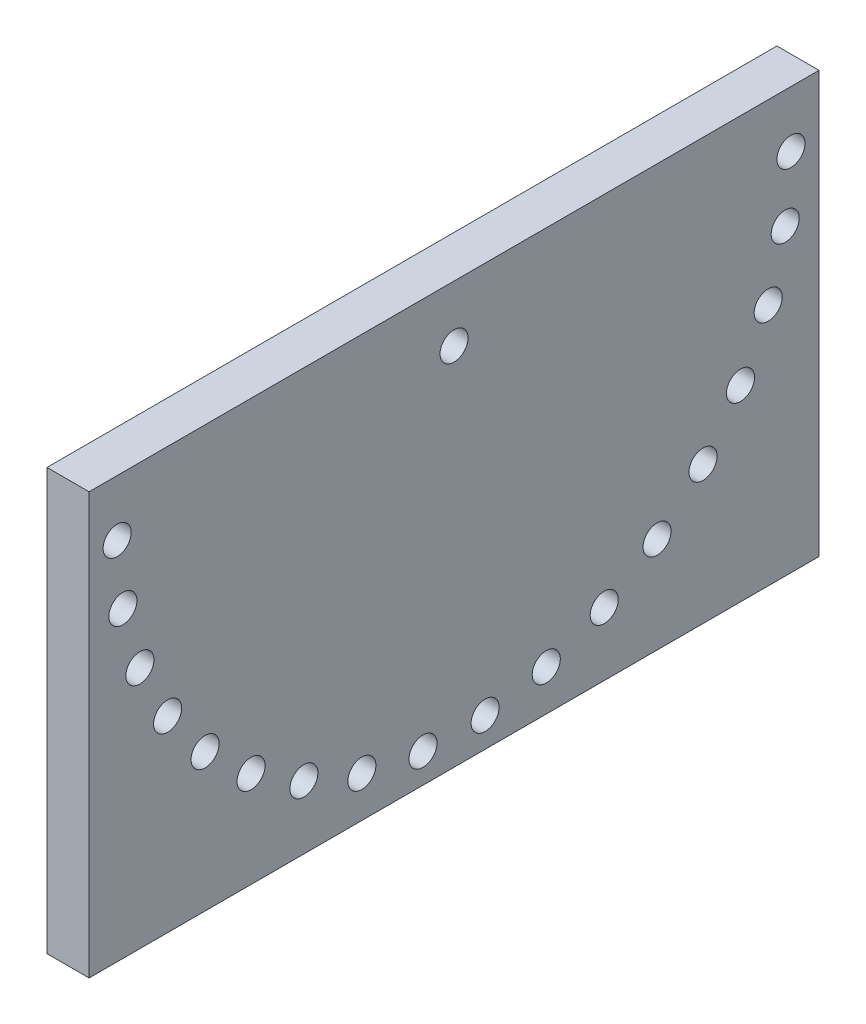
ISO-10303-21;
HEADER;
FILE_DESCRIPTION(('STEP AP214'),'2;1');
FILE_NAME('part.step','',(''),(''),'','','');
FILE_SCHEMA(('AUTOMOTIVE_DESIGN { 1 0 10303 214 1 1 1 1 }'));
ENDSEC;
DATA;
#1=APPLICATION_CONTEXT('core data for automotive mechanical design processes');
#2=APPLICATION_PROTOCOL_DEFINITION('international standard','automotive_design',2000,#1);
#3=PRODUCT_CONTEXT('',#1,'mechanical');
#4=PRODUCT('Part','Part','',(#3));
#5=PRODUCT_RELATED_PRODUCT_CATEGORY('part','',(#4));
#6=PRODUCT_DEFINITION_FORMATION('','',#4);
#7=PRODUCT_DEFINITION_CONTEXT('part definition',#1,'design');
#8=PRODUCT_DEFINITION('design','',#6,#7);
#9=PRODUCT_DEFINITION_SHAPE('','',#8);
#10=(LENGTH_UNIT() NAMED_UNIT(*) SI_UNIT(.MILLI.,.METRE.));
#11=(NAMED_UNIT(*) PLANE_ANGLE_UNIT() SI_UNIT($,.RADIAN.));
#12=(NAMED_UNIT(*) SI_UNIT($,.STERADIAN.) SOLID_ANGLE_UNIT());
#13=UNCERTAINTY_MEASURE_WITH_UNIT(LENGTH_MEASURE(1.E-05),#10,'distance_accuracy_value','');
#14=(GEOMETRIC_REPRESENTATION_CONTEXT(3) GLOBAL_UNCERTAINTY_ASSIGNED_CONTEXT((#13)) GLOBAL_UNIT_ASSIGNED_CONTEXT((#10,
#11,#12)) REPRESENTATION_CONTEXT('',''));
#15=CARTESIAN_POINT('',(0.,0.,0.));
#16=DIRECTION('',(0.,0.,1.));
#17=DIRECTION('',(1.,0.,0.));
#18=AXIS2_PLACEMENT_3D('',#15,#16,#17);
#19=CARTESIAN_POINT('',(15.,75.,-130.));
#20=DIRECTION('',(0.,0.,1.));
#21=DIRECTION('',(1.,0.,0.));
#22=AXIS2_PLACEMENT_3D('',#19,#20,#21);
#23=PLANE('',#22);
#24=DIRECTION('',(0.,1.,0.));
#25=VECTOR('',#24,1.);
#26=CARTESIAN_POINT('',(0.,75.,-130.));
#27=LINE('',#26,#25);
#28=CARTESIAN_POINT('',(0.,-75.,-130.));
#29=VERTEX_POINT('',#28);
#30=CARTESIAN_POINT('',(0.,75.,-130.));
#31=VERTEX_POINT('',#30);
#32=EDGE_CURVE('E100',#29,#31,#27,.T.);
#33=ORIENTED_EDGE('',*,*,#32,.T.);
#34=DIRECTION('',(-1.,0.,0.));
#35=VECTOR('',#34,1.);
#36=CARTESIAN_POINT('',(15.,75.,-130.));
#37=LINE('',#36,#35);
#38=CARTESIAN_POINT('',(15.,75.,-130.));
#39=VERTEX_POINT('',#38);
#40=EDGE_CURVE('E11',#39,#31,#37,.T.);
#41=ORIENTED_EDGE('',*,*,#40,.F.);
#42=DIRECTION('',(0.,1.,0.));
#43=VECTOR('',#42,1.);
#44=CARTESIAN_POINT('',(15.,75.,-130.));
#45=LINE('',#44,#43);
#46=CARTESIAN_POINT('',(15.,-75.,-130.));
#47=VERTEX_POINT('',#46);
#48=EDGE_CURVE('E88',#47,#39,#45,.T.);
#49=ORIENTED_EDGE('',*,*,#48,.F.);
#50=DIRECTION('',(-1.,0.,0.));
#51=VECTOR('',#50,1.);
#52=CARTESIAN_POINT('',(15.,-75.,-130.));
#53=LINE('',#52,#51);
#54=EDGE_CURVE('E96',#47,#29,#53,.T.);
#55=ORIENTED_EDGE('',*,*,#54,.T.);
#56=EDGE_LOOP('',(#33,#41,#49,#55));
#57=FACE_BOUND('',#56,.T.);
#58=ADVANCED_FACE('F37',(#57),#23,.F.);
#59=CARTESIAN_POINT('',(15.,75.,130.));
#60=DIRECTION('',(0.,-1.,0.));
#61=DIRECTION('',(0.,0.,-1.));
#62=AXIS2_PLACEMENT_3D('',#59,#60,#61);
#63=PLANE('',#62);
#64=DIRECTION('',(0.,0.,1.));
#65=VECTOR('',#64,1.);
#66=CARTESIAN_POINT('',(0.,75.,130.));
#67=LINE('',#66,#65);
#68=CARTESIAN_POINT('',(0.,75.,130.));
#69=VERTEX_POINT('',#68);
#70=EDGE_CURVE('E92',#31,#69,#67,.T.);
#71=ORIENTED_EDGE('',*,*,#70,.T.);
#72=DIRECTION('',(-1.,0.,0.));
#73=VECTOR('',#72,1.);
#74=CARTESIAN_POINT('',(15.,75.,130.));
#75=LINE('',#74,#73);
#76=CARTESIAN_POINT('',(15.,75.,130.));
#77=VERTEX_POINT('',#76);
#78=EDGE_CURVE('E45',#77,#69,#75,.T.);
#79=ORIENTED_EDGE('',*,*,#78,.F.);
#80=DIRECTION('',(0.,0.,1.));
#81=VECTOR('',#80,1.);
#82=CARTESIAN_POINT('',(15.,75.,130.));
#83=LINE('',#82,#81);
#84=EDGE_CURVE('E83',#39,#77,#83,.T.);
#85=ORIENTED_EDGE('',*,*,#84,.F.);
#86=ORIENTED_EDGE('',*,*,#40,.T.);
#87=EDGE_LOOP('',(#71,#79,#85,#86));
#88=FACE_BOUND('',#87,.T.);
#89=ADVANCED_FACE('F91',(#88),#63,.F.);
#90=CARTESIAN_POINT('',(15.,75.,130.));
#91=DIRECTION('',(0.,0.,-1.));
#92=DIRECTION('',(0.,1.,0.));
#93=AXIS2_PLACEMENT_3D('',#90,#91,#92);
#94=PLANE('',#93);
#95=DIRECTION('',(0.,-1.,0.));
#96=VECTOR('',#95,1.);
#97=CARTESIAN_POINT('',(0.,75.,130.));
#98=LINE('',#97,#96);
#99=CARTESIAN_POINT('',(0.,-75.,130.));
#100=VERTEX_POINT('',#99);
#101=EDGE_CURVE('E70',#69,#100,#98,.T.);
#102=ORIENTED_EDGE('',*,*,#101,.T.);
#103=DIRECTION('',(-1.,0.,0.));
#104=VECTOR('',#103,1.);
#105=CARTESIAN_POINT('',(15.,-75.,130.));
#106=LINE('',#105,#104);
#107=CARTESIAN_POINT('',(15.,-75.,130.));
#108=VERTEX_POINT('',#107);
#109=EDGE_CURVE('E93',#108,#100,#106,.T.);
#110=ORIENTED_EDGE('',*,*,#109,.F.);
#111=DIRECTION('',(0.,-1.,0.));
#112=VECTOR('',#111,1.);
#113=CARTESIAN_POINT('',(15.,75.,130.));
#114=LINE('',#113,#112);
#115=EDGE_CURVE('E86',#77,#108,#114,.T.);
#116=ORIENTED_EDGE('',*,*,#115,.F.);
#117=ORIENTED_EDGE('',*,*,#78,.T.);
#118=EDGE_LOOP('',(#102,#110,#116,#117));
#119=FACE_BOUND('',#118,.T.);
#120=ADVANCED_FACE('F94',(#119),#94,.F.);
#121=CARTESIAN_POINT('',(15.,-75.,130.));
#122=DIRECTION('',(0.,1.,0.));
#123=DIRECTION('',(0.,0.,1.));
#124=AXIS2_PLACEMENT_3D('',#121,#122,#123);
#125=PLANE('',#124);
#126=DIRECTION('',(0.,0.,-1.));
#127=VECTOR('',#126,1.);
#128=CARTESIAN_POINT('',(0.,-75.,130.));
#129=LINE('',#128,#127);
#130=EDGE_CURVE('E76',#100,#29,#129,.T.);
#131=ORIENTED_EDGE('',*,*,#130,.T.);
#132=ORIENTED_EDGE('',*,*,#54,.F.);
#133=DIRECTION('',(0.,0.,-1.));
#134=VECTOR('',#133,1.);
#135=CARTESIAN_POINT('',(15.,-75.,130.));
#136=LINE('',#135,#134);
#137=EDGE_CURVE('E53',#108,#47,#136,.T.);
#138=ORIENTED_EDGE('',*,*,#137,.F.);
#139=ORIENTED_EDGE('',*,*,#109,.T.);
#140=EDGE_LOOP('',(#131,#132,#138,#139));
#141=FACE_BOUND('',#140,.T.);
#142=ADVANCED_FACE('F108',(#141),#125,.F.);
#143=CARTESIAN_POINT('',(15.,0.,0.));
#144=DIRECTION('',(1.,0.,0.));
#145=DIRECTION('',(0.,0.,-1.));
#146=AXIS2_PLACEMENT_3D('',#143,#144,#145);
#147=PLANE('',#146);
#148=CARTESIAN_POINT('',(15.,55.0000000000008,120.));
#149=DIRECTION('',(-1.,0.,0.));
#150=DIRECTION('',(0.,0.,1.));
#151=AXIS2_PLACEMENT_3D('',#148,#149,#150);
#152=CIRCLE('',#151,5.00000000000002);
#153=CARTESIAN_POINT('',(15.,55.0000000000008,125.));
#154=VERTEX_POINT('',#153);
#155=EDGE_CURVE('E219',#154,#154,#152,.T.);
#156=ORIENTED_EDGE('',*,*,#155,.T.);
#157=EDGE_LOOP('',(#156));
#158=FACE_BOUND('',#157,.T.);
#159=CARTESIAN_POINT('',(15.,32.9500578620124,117.956771962068));
#160=DIRECTION('',(-1.,0.,0.));
#161=DIRECTION('',(0.,0.,1.));
#162=AXIS2_PLACEMENT_3D('',#159,#160,#161);
#163=CIRCLE('',#162,5.);
#164=CARTESIAN_POINT('',(15.,32.9500578620124,122.956771962068));
#165=VERTEX_POINT('',#164);
#166=EDGE_CURVE('E213',#165,#165,#163,.T.);
#167=ORIENTED_EDGE('',*,*,#166,.T.);
#168=EDGE_LOOP('',(#167));
#169=FACE_BOUND('',#168,.T.);
#170=CARTESIAN_POINT('',(15.,11.6510000575423,111.896667528523));
#171=DIRECTION('',(-1.,0.,0.));
#172=DIRECTION('',(0.,0.,1.));
#173=AXIS2_PLACEMENT_3D('',#170,#171,#172);
#174=CIRCLE('',#173,5.);
#175=CARTESIAN_POINT('',(15.,11.6510000575423,116.896667528523));
#176=VERTEX_POINT('',#175);
#177=EDGE_CURVE('E207',#176,#176,#174,.T.);
#178=ORIENTED_EDGE('',*,*,#177,.T.);
#179=EDGE_LOOP('',(#178));
#180=FACE_BOUND('',#179,.T.);
#181=CARTESIAN_POINT('',(15.,-8.17185954528207,102.026056287554));
#182=DIRECTION('',(-1.,0.,0.));
#183=DIRECTION('',(0.,0.,1.));
#184=AXIS2_PLACEMENT_3D('',#181,#182,#183);
#185=CIRCLE('',#184,5.);
#186=CARTESIAN_POINT('',(15.,-8.17185954528207,107.026056287554));
#187=VERTEX_POINT('',#186);
#188=EDGE_CURVE('E201',#187,#187,#185,.T.);
#189=ORIENTED_EDGE('',*,*,#188,.T.);
#190=EDGE_LOOP('',(#189));
#191=FACE_BOUND('',#190,.T.);
#192=CARTESIAN_POINT('',(15.,-25.8434772375864,88.6810700664795));
#193=DIRECTION('',(-1.,0.,0.));
#194=DIRECTION('',(0.,0.,1.));
#195=AXIS2_PLACEMENT_3D('',#192,#193,#194);
#196=CIRCLE('',#195,5.);
#197=CARTESIAN_POINT('',(15.,-25.8434772375864,93.6810700664795));
#198=VERTEX_POINT('',#197);
#199=EDGE_CURVE('E195',#198,#198,#196,.T.);
#200=ORIENTED_EDGE('',*,*,#199,.T.);
#201=EDGE_LOOP('',(#200));
#202=FACE_BOUND('',#201,.T.);
#203=CARTESIAN_POINT('',(15.,-40.7620672736284,72.3161563655112));
#204=DIRECTION('',(-1.,0.,0.));
#205=DIRECTION('',(0.,0.,1.));
#206=AXIS2_PLACEMENT_3D('',#203,#204,#205);
#207=CIRCLE('',#206,5.00000000000001);
#208=CARTESIAN_POINT('',(15.,-40.7620672736284,77.3161563655113));
#209=VERTEX_POINT('',#208);
#210=EDGE_CURVE('E189',#209,#209,#207,.T.);
#211=ORIENTED_EDGE('',*,*,#210,.T.);
#212=EDGE_LOOP('',(#211));
#213=FACE_BOUND('',#212,.T.);
#214=CARTESIAN_POINT('',(15.,-52.4195949626073,53.4886026931851));
#215=DIRECTION('',(-1.,0.,0.));
#216=DIRECTION('',(0.,0.,1.));
#217=AXIS2_PLACEMENT_3D('',#214,#215,#216);
#218=CIRCLE('',#217,5.00000000000002);
#219=CARTESIAN_POINT('',(15.,-52.4195949626073,58.4886026931851));
#220=VERTEX_POINT('',#219);
#221=EDGE_CURVE('E183',#220,#220,#218,.T.);
#222=ORIENTED_EDGE('',*,*,#221,.T.);
#223=EDGE_LOOP('',(#222));
#224=FACE_BOUND('',#223,.T.);
#225=CARTESIAN_POINT('',(15.,-60.4190771807382,32.8395588086504));
#226=DIRECTION('',(-1.,0.,0.));
#227=DIRECTION('',(0.,0.,1.));
#228=AXIS2_PLACEMENT_3D('',#225,#226,#227);
#229=CIRCLE('',#228,5.00000000000002);
#230=CARTESIAN_POINT('',(15.,-60.4190771807382,37.8395588086504));
#231=VERTEX_POINT('',#230);
#232=EDGE_CURVE('E177',#231,#231,#229,.T.);
#233=ORIENTED_EDGE('',*,*,#232,.T.);
#234=EDGE_LOOP('',(#233));
#235=FACE_BOUND('',#234,.T.);
#236=CARTESIAN_POINT('',(15.,-64.4881011554041,11.0722031355967));
#237=DIRECTION('',(-1.,0.,0.));
#238=DIRECTION('',(0.,0.,1.));
#239=AXIS2_PLACEMENT_3D('',#236,#237,#238);
#240=CIRCLE('',#239,5.00000000000001);
#241=CARTESIAN_POINT('',(15.,-64.4881011554041,16.0722031355967));
#242=VERTEX_POINT('',#241);
#243=EDGE_CURVE('E171',#242,#242,#240,.T.);
#244=ORIENTED_EDGE('',*,*,#243,.T.);
#245=EDGE_LOOP('',(#244));
#246=FACE_BOUND('',#245,.T.);
#247=CARTESIAN_POINT('',(15.,-64.4881011554042,-11.0722031355959));
#248=DIRECTION('',(-1.,0.,0.));
#249=DIRECTION('',(0.,0.,1.));
#250=AXIS2_PLACEMENT_3D('',#247,#248,#249);
#251=CIRCLE('',#250,5.00000000000002);
#252=CARTESIAN_POINT('',(15.,-64.4881011554042,-6.07220313559584));
#253=VERTEX_POINT('',#252);
#254=EDGE_CURVE('E165',#253,#253,#251,.T.);
#255=ORIENTED_EDGE('',*,*,#254,.T.);
#256=EDGE_LOOP('',(#255));
#257=FACE_BOUND('',#256,.T.);
#258=CARTESIAN_POINT('',(15.,-60.4190771807384,-32.8395588086496));
#259=DIRECTION('',(-1.,0.,0.));
#260=DIRECTION('',(0.,0.,1.));
#261=AXIS2_PLACEMENT_3D('',#258,#259,#260);
#262=CIRCLE('',#261,5.00000000000001);
#263=CARTESIAN_POINT('',(15.,-60.4190771807384,-27.8395588086496));
#264=VERTEX_POINT('',#263);
#265=EDGE_CURVE('E159',#264,#264,#262,.T.);
#266=ORIENTED_EDGE('',*,*,#265,.T.);
#267=EDGE_LOOP('',(#266));
#268=FACE_BOUND('',#267,.T.);
#269=CARTESIAN_POINT('',(15.,-52.4195949626076,-53.4886026931843));
#270=DIRECTION('',(-1.,0.,0.));
#271=DIRECTION('',(0.,0.,1.));
#272=AXIS2_PLACEMENT_3D('',#269,#270,#271);
#273=CIRCLE('',#272,5.00000000000001);
#274=CARTESIAN_POINT('',(15.,-52.4195949626076,-48.4886026931843));
#275=VERTEX_POINT('',#274);
#276=EDGE_CURVE('E153',#275,#275,#273,.T.);
#277=ORIENTED_EDGE('',*,*,#276,.T.);
#278=EDGE_LOOP('',(#277));
#279=FACE_BOUND('',#278,.T.);
#280=CARTESIAN_POINT('',(15.,-40.7620672736289,-72.3161563655106));
#281=DIRECTION('',(-1.,0.,0.));
#282=DIRECTION('',(0.,0.,1.));
#283=AXIS2_PLACEMENT_3D('',#280,#281,#282);
#284=CIRCLE('',#283,5.);
#285=CARTESIAN_POINT('',(15.,-40.7620672736289,-67.3161563655106));
#286=VERTEX_POINT('',#285);
#287=EDGE_CURVE('E147',#286,#286,#284,.T.);
#288=ORIENTED_EDGE('',*,*,#287,.T.);
#289=EDGE_LOOP('',(#288));
#290=FACE_BOUND('',#289,.T.);
#291=CARTESIAN_POINT('',(15.,-25.843477237587,-88.681070066479));
#292=DIRECTION('',(-1.,0.,0.));
#293=DIRECTION('',(0.,0.,1.));
#294=AXIS2_PLACEMENT_3D('',#291,#292,#293);
#295=CIRCLE('',#294,5.00000000000001);
#296=CARTESIAN_POINT('',(15.,-25.843477237587,-83.681070066479));
#297=VERTEX_POINT('',#296);
#298=EDGE_CURVE('E141',#297,#297,#295,.T.);
#299=ORIENTED_EDGE('',*,*,#298,.T.);
#300=EDGE_LOOP('',(#299));
#301=FACE_BOUND('',#300,.T.);
#302=CARTESIAN_POINT('',(15.,-8.17185954528284,-102.026056287554));
#303=DIRECTION('',(-1.,0.,0.));
#304=DIRECTION('',(0.,0.,1.));
#305=AXIS2_PLACEMENT_3D('',#302,#303,#304);
#306=CIRCLE('',#305,5.);
#307=CARTESIAN_POINT('',(15.,-8.17185954528284,-97.0260562875536));
#308=VERTEX_POINT('',#307);
#309=EDGE_CURVE('E135',#308,#308,#306,.T.);
#310=ORIENTED_EDGE('',*,*,#309,.T.);
#311=EDGE_LOOP('',(#310));
#312=FACE_BOUND('',#311,.T.);
#313=CARTESIAN_POINT('',(15.,11.6510000575415,-111.896667528523));
#314=DIRECTION('',(-1.,0.,0.));
#315=DIRECTION('',(0.,0.,1.));
#316=AXIS2_PLACEMENT_3D('',#313,#314,#315);
#317=CIRCLE('',#316,5.00000000000001);
#318=CARTESIAN_POINT('',(15.,11.6510000575415,-106.896667528523));
#319=VERTEX_POINT('',#318);
#320=EDGE_CURVE('E129',#319,#319,#317,.T.);
#321=ORIENTED_EDGE('',*,*,#320,.T.);
#322=EDGE_LOOP('',(#321));
#323=FACE_BOUND('',#322,.T.);
#324=CARTESIAN_POINT('',(15.,32.9500578620115,-117.956771962068));
#325=DIRECTION('',(-1.,0.,0.));
#326=DIRECTION('',(0.,0.,1.));
#327=AXIS2_PLACEMENT_3D('',#324,#325,#326);
#328=CIRCLE('',#327,5.00000000000001);
#329=CARTESIAN_POINT('',(15.,32.9500578620115,-112.956771962068));
#330=VERTEX_POINT('',#329);
#331=EDGE_CURVE('E123',#330,#330,#328,.T.);
#332=ORIENTED_EDGE('',*,*,#331,.T.);
#333=EDGE_LOOP('',(#332));
#334=FACE_BOUND('',#333,.T.);
#335=CARTESIAN_POINT('',(15.,55.,-120.));
#336=DIRECTION('',(-1.,0.,0.));
#337=DIRECTION('',(0.,0.,1.));
#338=AXIS2_PLACEMENT_3D('',#335,#336,#337);
#339=CIRCLE('',#338,5.00000000000001);
#340=CARTESIAN_POINT('',(15.,55.,-115.));
#341=VERTEX_POINT('',#340);
#342=EDGE_CURVE('E117',#341,#341,#339,.T.);
#343=ORIENTED_EDGE('',*,*,#342,.T.);
#344=EDGE_LOOP('',(#343));
#345=FACE_BOUND('',#344,.T.);
#346=CARTESIAN_POINT('',(15.,55.,0.));
#347=DIRECTION('',(-1.,0.,0.));
#348=DIRECTION('',(0.,0.,1.));
#349=AXIS2_PLACEMENT_3D('',#346,#347,#348);
#350=CIRCLE('',#349,5.);
#351=CARTESIAN_POINT('',(15.,55.,5.));
#352=VERTEX_POINT('',#351);
#353=EDGE_CURVE('E103',#352,#352,#350,.T.);
#354=ORIENTED_EDGE('',*,*,#353,.T.);
#355=EDGE_LOOP('',(#354));
#356=FACE_BOUND('',#355,.T.);
#357=ORIENTED_EDGE('',*,*,#48,.T.);
#358=ORIENTED_EDGE('',*,*,#84,.T.);
#359=ORIENTED_EDGE('',*,*,#115,.T.);
#360=ORIENTED_EDGE('',*,*,#137,.T.);
#361=EDGE_LOOP('',(#357,#358,#359,#360));
#362=FACE_BOUND('',#361,.T.);
#363=ADVANCED_FACE('F84',(#158,#169,#180,#191,#202,#213,#224,#235,#246,#257,#268,#279,#290,#301,
#312,#323,#334,#345,#356,#362),#147,.T.);
#364=CARTESIAN_POINT('',(0.,0.,0.));
#365=DIRECTION('',(1.,0.,0.));
#366=DIRECTION('',(0.,0.,-1.));
#367=AXIS2_PLACEMENT_3D('',#364,#365,#366);
#368=PLANE('',#367);
#369=CARTESIAN_POINT('',(0.,55.0000000000008,120.));
#370=DIRECTION('',(-1.,0.,0.));
#371=DIRECTION('',(0.,0.,1.));
#372=AXIS2_PLACEMENT_3D('',#369,#370,#371);
#373=CIRCLE('',#372,5.00000000000002);
#374=CARTESIAN_POINT('',(0.,55.0000000000008,125.));
#375=VERTEX_POINT('',#374);
#376=EDGE_CURVE('E222',#375,#375,#373,.T.);
#377=ORIENTED_EDGE('',*,*,#376,.F.);
#378=EDGE_LOOP('',(#377));
#379=FACE_BOUND('',#378,.T.);
#380=CARTESIAN_POINT('',(0.,32.9500578620124,117.956771962068));
#381=DIRECTION('',(-1.,0.,0.));
#382=DIRECTION('',(0.,0.,1.));
#383=AXIS2_PLACEMENT_3D('',#380,#381,#382);
#384=CIRCLE('',#383,5.);
#385=CARTESIAN_POINT('',(0.,32.9500578620124,122.956771962068));
#386=VERTEX_POINT('',#385);
#387=EDGE_CURVE('E216',#386,#386,#384,.T.);
#388=ORIENTED_EDGE('',*,*,#387,.F.);
#389=EDGE_LOOP('',(#388));
#390=FACE_BOUND('',#389,.T.);
#391=CARTESIAN_POINT('',(0.,11.6510000575423,111.896667528523));
#392=DIRECTION('',(-1.,0.,0.));
#393=DIRECTION('',(0.,0.,1.));
#394=AXIS2_PLACEMENT_3D('',#391,#392,#393);
#395=CIRCLE('',#394,5.);
#396=CARTESIAN_POINT('',(0.,11.6510000575423,116.896667528523));
#397=VERTEX_POINT('',#396);
#398=EDGE_CURVE('E210',#397,#397,#395,.T.);
#399=ORIENTED_EDGE('',*,*,#398,.F.);
#400=EDGE_LOOP('',(#399));
#401=FACE_BOUND('',#400,.T.);
#402=CARTESIAN_POINT('',(0.,-8.17185954528207,102.026056287554));
#403=DIRECTION('',(-1.,0.,0.));
#404=DIRECTION('',(0.,0.,1.));
#405=AXIS2_PLACEMENT_3D('',#402,#403,#404);
#406=CIRCLE('',#405,5.);
#407=CARTESIAN_POINT('',(0.,-8.17185954528207,107.026056287554));
#408=VERTEX_POINT('',#407);
#409=EDGE_CURVE('E204',#408,#408,#406,.T.);
#410=ORIENTED_EDGE('',*,*,#409,.F.);
#411=EDGE_LOOP('',(#410));
#412=FACE_BOUND('',#411,.T.);
#413=CARTESIAN_POINT('',(0.,-25.8434772375864,88.6810700664795));
#414=DIRECTION('',(-1.,0.,0.));
#415=DIRECTION('',(0.,0.,1.));
#416=AXIS2_PLACEMENT_3D('',#413,#414,#415);
#417=CIRCLE('',#416,5.);
#418=CARTESIAN_POINT('',(0.,-25.8434772375864,93.6810700664795));
#419=VERTEX_POINT('',#418);
#420=EDGE_CURVE('E198',#419,#419,#417,.T.);
#421=ORIENTED_EDGE('',*,*,#420,.F.);
#422=EDGE_LOOP('',(#421));
#423=FACE_BOUND('',#422,.T.);
#424=CARTESIAN_POINT('',(0.,-40.7620672736284,72.3161563655112));
#425=DIRECTION('',(-1.,0.,0.));
#426=DIRECTION('',(0.,0.,1.));
#427=AXIS2_PLACEMENT_3D('',#424,#425,#426);
#428=CIRCLE('',#427,5.00000000000001);
#429=CARTESIAN_POINT('',(0.,-40.7620672736284,77.3161563655113));
#430=VERTEX_POINT('',#429);
#431=EDGE_CURVE('E192',#430,#430,#428,.T.);
#432=ORIENTED_EDGE('',*,*,#431,.F.);
#433=EDGE_LOOP('',(#432));
#434=FACE_BOUND('',#433,.T.);
#435=CARTESIAN_POINT('',(0.,-52.4195949626073,53.4886026931851));
#436=DIRECTION('',(-1.,0.,0.));
#437=DIRECTION('',(0.,0.,1.));
#438=AXIS2_PLACEMENT_3D('',#435,#436,#437);
#439=CIRCLE('',#438,5.00000000000002);
#440=CARTESIAN_POINT('',(0.,-52.4195949626073,58.4886026931851));
#441=VERTEX_POINT('',#440);
#442=EDGE_CURVE('E186',#441,#441,#439,.T.);
#443=ORIENTED_EDGE('',*,*,#442,.F.);
#444=EDGE_LOOP('',(#443));
#445=FACE_BOUND('',#444,.T.);
#446=CARTESIAN_POINT('',(0.,-60.4190771807382,32.8395588086504));
#447=DIRECTION('',(-1.,0.,0.));
#448=DIRECTION('',(0.,0.,1.));
#449=AXIS2_PLACEMENT_3D('',#446,#447,#448);
#450=CIRCLE('',#449,5.00000000000002);
#451=CARTESIAN_POINT('',(0.,-60.4190771807382,37.8395588086504));
#452=VERTEX_POINT('',#451);
#453=EDGE_CURVE('E180',#452,#452,#450,.T.);
#454=ORIENTED_EDGE('',*,*,#453,.F.);
#455=EDGE_LOOP('',(#454));
#456=FACE_BOUND('',#455,.T.);
#457=CARTESIAN_POINT('',(0.,-64.4881011554041,11.0722031355967));
#458=DIRECTION('',(-1.,0.,0.));
#459=DIRECTION('',(0.,0.,1.));
#460=AXIS2_PLACEMENT_3D('',#457,#458,#459);
#461=CIRCLE('',#460,5.00000000000001);
#462=CARTESIAN_POINT('',(0.,-64.4881011554041,16.0722031355967));
#463=VERTEX_POINT('',#462);
#464=EDGE_CURVE('E174',#463,#463,#461,.T.);
#465=ORIENTED_EDGE('',*,*,#464,.F.);
#466=EDGE_LOOP('',(#465));
#467=FACE_BOUND('',#466,.T.);
#468=CARTESIAN_POINT('',(0.,-64.4881011554042,-11.0722031355959));
#469=DIRECTION('',(-1.,0.,0.));
#470=DIRECTION('',(0.,0.,1.));
#471=AXIS2_PLACEMENT_3D('',#468,#469,#470);
#472=CIRCLE('',#471,5.00000000000002);
#473=CARTESIAN_POINT('',(0.,-64.4881011554042,-6.07220313559584));
#474=VERTEX_POINT('',#473);
#475=EDGE_CURVE('E168',#474,#474,#472,.T.);
#476=ORIENTED_EDGE('',*,*,#475,.F.);
#477=EDGE_LOOP('',(#476));
#478=FACE_BOUND('',#477,.T.);
#479=CARTESIAN_POINT('',(0.,-60.4190771807384,-32.8395588086496));
#480=DIRECTION('',(-1.,0.,0.));
#481=DIRECTION('',(0.,0.,1.));
#482=AXIS2_PLACEMENT_3D('',#479,#480,#481);
#483=CIRCLE('',#482,5.00000000000001);
#484=CARTESIAN_POINT('',(0.,-60.4190771807384,-27.8395588086496));
#485=VERTEX_POINT('',#484);
#486=EDGE_CURVE('E162',#485,#485,#483,.T.);
#487=ORIENTED_EDGE('',*,*,#486,.F.);
#488=EDGE_LOOP('',(#487));
#489=FACE_BOUND('',#488,.T.);
#490=CARTESIAN_POINT('',(0.,-52.4195949626076,-53.4886026931843));
#491=DIRECTION('',(-1.,0.,0.));
#492=DIRECTION('',(0.,0.,1.));
#493=AXIS2_PLACEMENT_3D('',#490,#491,#492);
#494=CIRCLE('',#493,5.00000000000001);
#495=CARTESIAN_POINT('',(0.,-52.4195949626076,-48.4886026931843));
#496=VERTEX_POINT('',#495);
#497=EDGE_CURVE('E156',#496,#496,#494,.T.);
#498=ORIENTED_EDGE('',*,*,#497,.F.);
#499=EDGE_LOOP('',(#498));
#500=FACE_BOUND('',#499,.T.);
#501=CARTESIAN_POINT('',(0.,-40.7620672736289,-72.3161563655106));
#502=DIRECTION('',(-1.,0.,0.));
#503=DIRECTION('',(0.,0.,1.));
#504=AXIS2_PLACEMENT_3D('',#501,#502,#503);
#505=CIRCLE('',#504,5.);
#506=CARTESIAN_POINT('',(0.,-40.7620672736289,-67.3161563655106));
#507=VERTEX_POINT('',#506);
#508=EDGE_CURVE('E150',#507,#507,#505,.T.);
#509=ORIENTED_EDGE('',*,*,#508,.F.);
#510=EDGE_LOOP('',(#509));
#511=FACE_BOUND('',#510,.T.);
#512=CARTESIAN_POINT('',(0.,-25.843477237587,-88.681070066479));
#513=DIRECTION('',(-1.,0.,0.));
#514=DIRECTION('',(0.,0.,1.));
#515=AXIS2_PLACEMENT_3D('',#512,#513,#514);
#516=CIRCLE('',#515,5.00000000000001);
#517=CARTESIAN_POINT('',(0.,-25.843477237587,-83.681070066479));
#518=VERTEX_POINT('',#517);
#519=EDGE_CURVE('E144',#518,#518,#516,.T.);
#520=ORIENTED_EDGE('',*,*,#519,.F.);
#521=EDGE_LOOP('',(#520));
#522=FACE_BOUND('',#521,.T.);
#523=CARTESIAN_POINT('',(0.,-8.17185954528284,-102.026056287554));
#524=DIRECTION('',(-1.,0.,0.));
#525=DIRECTION('',(0.,0.,1.));
#526=AXIS2_PLACEMENT_3D('',#523,#524,#525);
#527=CIRCLE('',#526,5.);
#528=CARTESIAN_POINT('',(0.,-8.17185954528284,-97.0260562875536));
#529=VERTEX_POINT('',#528);
#530=EDGE_CURVE('E138',#529,#529,#527,.T.);
#531=ORIENTED_EDGE('',*,*,#530,.F.);
#532=EDGE_LOOP('',(#531));
#533=FACE_BOUND('',#532,.T.);
#534=CARTESIAN_POINT('',(0.,11.6510000575415,-111.896667528523));
#535=DIRECTION('',(-1.,0.,0.));
#536=DIRECTION('',(0.,0.,1.));
#537=AXIS2_PLACEMENT_3D('',#534,#535,#536);
#538=CIRCLE('',#537,5.00000000000001);
#539=CARTESIAN_POINT('',(0.,11.6510000575415,-106.896667528523));
#540=VERTEX_POINT('',#539);
#541=EDGE_CURVE('E132',#540,#540,#538,.T.);
#542=ORIENTED_EDGE('',*,*,#541,.F.);
#543=EDGE_LOOP('',(#542));
#544=FACE_BOUND('',#543,.T.);
#545=CARTESIAN_POINT('',(0.,32.9500578620115,-117.956771962068));
#546=DIRECTION('',(-1.,0.,0.));
#547=DIRECTION('',(0.,0.,1.));
#548=AXIS2_PLACEMENT_3D('',#545,#546,#547);
#549=CIRCLE('',#548,5.00000000000001);
#550=CARTESIAN_POINT('',(0.,32.9500578620115,-112.956771962068));
#551=VERTEX_POINT('',#550);
#552=EDGE_CURVE('E126',#551,#551,#549,.T.);
#553=ORIENTED_EDGE('',*,*,#552,.F.);
#554=EDGE_LOOP('',(#553));
#555=FACE_BOUND('',#554,.T.);
#556=CARTESIAN_POINT('',(0.,55.,-120.));
#557=DIRECTION('',(-1.,0.,0.));
#558=DIRECTION('',(0.,0.,1.));
#559=AXIS2_PLACEMENT_3D('',#556,#557,#558);
#560=CIRCLE('',#559,5.00000000000001);
#561=CARTESIAN_POINT('',(0.,55.,-115.));
#562=VERTEX_POINT('',#561);
#563=EDGE_CURVE('E120',#562,#562,#560,.T.);
#564=ORIENTED_EDGE('',*,*,#563,.F.);
#565=EDGE_LOOP('',(#564));
#566=FACE_BOUND('',#565,.T.);
#567=CARTESIAN_POINT('',(0.,55.,0.));
#568=DIRECTION('',(-1.,0.,0.));
#569=DIRECTION('',(0.,0.,1.));
#570=AXIS2_PLACEMENT_3D('',#567,#568,#569);
#571=CIRCLE('',#570,5.);
#572=CARTESIAN_POINT('',(0.,55.,5.));
#573=VERTEX_POINT('',#572);
#574=EDGE_CURVE('E114',#573,#573,#571,.T.);
#575=ORIENTED_EDGE('',*,*,#574,.F.);
#576=EDGE_LOOP('',(#575));
#577=FACE_BOUND('',#576,.T.);
#578=ORIENTED_EDGE('',*,*,#32,.F.);
#579=ORIENTED_EDGE('',*,*,#130,.F.);
#580=ORIENTED_EDGE('',*,*,#101,.F.);
#581=ORIENTED_EDGE('',*,*,#70,.F.);
#582=EDGE_LOOP('',(#578,#579,#580,#581));
#583=FACE_BOUND('',#582,.T.);
#584=ADVANCED_FACE('F111',(#379,#390,#401,#412,#423,#434,#445,#456,#467,#478,#489,#500,#511,
#522,#533,#544,#555,#566,#577,#583),#368,.F.);
#585=CARTESIAN_POINT('',(15.,55.,0.));
#586=DIRECTION('',(-1.,0.,0.));
#587=DIRECTION('',(0.,0.,1.));
#588=AXIS2_PLACEMENT_3D('',#585,#586,#587);
#589=CYLINDRICAL_SURFACE('',#588,5.);
#590=ORIENTED_EDGE('',*,*,#353,.F.);
#591=EDGE_LOOP('',(#590));
#592=FACE_BOUND('',#591,.T.);
#593=ORIENTED_EDGE('',*,*,#574,.T.);
#594=EDGE_LOOP('',(#593));
#595=FACE_BOUND('',#594,.T.);
#596=ADVANCED_FACE('F239',(#592,#595),#589,.F.);
#597=CARTESIAN_POINT('',(15.,55.,-120.));
#598=DIRECTION('',(-1.,0.,0.));
#599=DIRECTION('',(0.,0.,1.));
#600=AXIS2_PLACEMENT_3D('',#597,#598,#599);
#601=CYLINDRICAL_SURFACE('',#600,5.00000000000001);
#602=ORIENTED_EDGE('',*,*,#342,.F.);
#603=EDGE_LOOP('',(#602));
#604=FACE_BOUND('',#603,.T.);
#605=ORIENTED_EDGE('',*,*,#563,.T.);
#606=EDGE_LOOP('',(#605));
#607=FACE_BOUND('',#606,.T.);
#608=ADVANCED_FACE('F278',(#604,#607),#601,.F.);
#609=CARTESIAN_POINT('',(15.,32.9500578620115,-117.956771962068));
#610=DIRECTION('',(-1.,0.,0.));
#611=DIRECTION('',(0.,0.,1.));
#612=AXIS2_PLACEMENT_3D('',#609,#610,#611);
#613=CYLINDRICAL_SURFACE('',#612,5.00000000000001);
#614=ORIENTED_EDGE('',*,*,#331,.F.);
#615=EDGE_LOOP('',(#614));
#616=FACE_BOUND('',#615,.T.);
#617=ORIENTED_EDGE('',*,*,#552,.T.);
#618=EDGE_LOOP('',(#617));
#619=FACE_BOUND('',#618,.T.);
#620=ADVANCED_FACE('F284',(#616,#619),#613,.F.);
#621=CARTESIAN_POINT('',(15.,11.6510000575415,-111.896667528523));
#622=DIRECTION('',(-1.,0.,0.));
#623=DIRECTION('',(0.,0.,1.));
#624=AXIS2_PLACEMENT_3D('',#621,#622,#623);
#625=CYLINDRICAL_SURFACE('',#624,5.00000000000001);
#626=ORIENTED_EDGE('',*,*,#320,.F.);
#627=EDGE_LOOP('',(#626));
#628=FACE_BOUND('',#627,.T.);
#629=ORIENTED_EDGE('',*,*,#541,.T.);
#630=EDGE_LOOP('',(#629));
#631=FACE_BOUND('',#630,.T.);
#632=ADVANCED_FACE('F324',(#628,#631),#625,.F.);
#633=CARTESIAN_POINT('',(15.,-8.17185954528284,-102.026056287554));
#634=DIRECTION('',(-1.,0.,0.));
#635=DIRECTION('',(0.,0.,1.));
#636=AXIS2_PLACEMENT_3D('',#633,#634,#635);
#637=CYLINDRICAL_SURFACE('',#636,5.);
#638=ORIENTED_EDGE('',*,*,#309,.F.);
#639=EDGE_LOOP('',(#638));
#640=FACE_BOUND('',#639,.T.);
#641=ORIENTED_EDGE('',*,*,#530,.T.);
#642=EDGE_LOOP('',(#641));
#643=FACE_BOUND('',#642,.T.);
#644=ADVANCED_FACE('F334',(#640,#643),#637,.F.);
#645=CARTESIAN_POINT('',(15.,-25.843477237587,-88.681070066479));
#646=DIRECTION('',(-1.,0.,0.));
#647=DIRECTION('',(0.,0.,1.));
#648=AXIS2_PLACEMENT_3D('',#645,#646,#647);
#649=CYLINDRICAL_SURFACE('',#648,5.00000000000001);
#650=ORIENTED_EDGE('',*,*,#298,.F.);
#651=EDGE_LOOP('',(#650));
#652=FACE_BOUND('',#651,.T.);
#653=ORIENTED_EDGE('',*,*,#519,.T.);
#654=EDGE_LOOP('',(#653));
#655=FACE_BOUND('',#654,.T.);
#656=ADVANCED_FACE('F344',(#652,#655),#649,.F.);
#657=CARTESIAN_POINT('',(15.,-40.7620672736289,-72.3161563655106));
#658=DIRECTION('',(-1.,0.,0.));
#659=DIRECTION('',(0.,0.,1.));
#660=AXIS2_PLACEMENT_3D('',#657,#658,#659);
#661=CYLINDRICAL_SURFACE('',#660,5.);
#662=ORIENTED_EDGE('',*,*,#287,.F.);
#663=EDGE_LOOP('',(#662));
#664=FACE_BOUND('',#663,.T.);
#665=ORIENTED_EDGE('',*,*,#508,.T.);
#666=EDGE_LOOP('',(#665));
#667=FACE_BOUND('',#666,.T.);
#668=ADVANCED_FACE('F354',(#664,#667),#661,.F.);
#669=CARTESIAN_POINT('',(15.,-52.4195949626076,-53.4886026931843));
#670=DIRECTION('',(-1.,0.,0.));
#671=DIRECTION('',(0.,0.,1.));
#672=AXIS2_PLACEMENT_3D('',#669,#670,#671);
#673=CYLINDRICAL_SURFACE('',#672,5.00000000000001);
#674=ORIENTED_EDGE('',*,*,#276,.F.);
#675=EDGE_LOOP('',(#674));
#676=FACE_BOUND('',#675,.T.);
#677=ORIENTED_EDGE('',*,*,#497,.T.);
#678=EDGE_LOOP('',(#677));
#679=FACE_BOUND('',#678,.T.);
#680=ADVANCED_FACE('F364',(#676,#679),#673,.F.);
#681=CARTESIAN_POINT('',(15.,-60.4190771807384,-32.8395588086496));
#682=DIRECTION('',(-1.,0.,0.));
#683=DIRECTION('',(0.,0.,1.));
#684=AXIS2_PLACEMENT_3D('',#681,#682,#683);
#685=CYLINDRICAL_SURFACE('',#684,5.00000000000001);
#686=ORIENTED_EDGE('',*,*,#265,.F.);
#687=EDGE_LOOP('',(#686));
#688=FACE_BOUND('',#687,.T.);
#689=ORIENTED_EDGE('',*,*,#486,.T.);
#690=EDGE_LOOP('',(#689));
#691=FACE_BOUND('',#690,.T.);
#692=ADVANCED_FACE('F374',(#688,#691),#685,.F.);
#693=CARTESIAN_POINT('',(15.,-64.4881011554042,-11.0722031355959));
#694=DIRECTION('',(-1.,0.,0.));
#695=DIRECTION('',(0.,0.,1.));
#696=AXIS2_PLACEMENT_3D('',#693,#694,#695);
#697=CYLINDRICAL_SURFACE('',#696,5.00000000000002);
#698=ORIENTED_EDGE('',*,*,#254,.F.);
#699=EDGE_LOOP('',(#698));
#700=FACE_BOUND('',#699,.T.);
#701=ORIENTED_EDGE('',*,*,#475,.T.);
#702=EDGE_LOOP('',(#701));
#703=FACE_BOUND('',#702,.T.);
#704=ADVANCED_FACE('F384',(#700,#703),#697,.F.);
#705=CARTESIAN_POINT('',(15.,-64.4881011554041,11.0722031355967));
#706=DIRECTION('',(-1.,0.,0.));
#707=DIRECTION('',(0.,0.,1.));
#708=AXIS2_PLACEMENT_3D('',#705,#706,#707);
#709=CYLINDRICAL_SURFACE('',#708,5.00000000000001);
#710=ORIENTED_EDGE('',*,*,#243,.F.);
#711=EDGE_LOOP('',(#710));
#712=FACE_BOUND('',#711,.T.);
#713=ORIENTED_EDGE('',*,*,#464,.T.);
#714=EDGE_LOOP('',(#713));
#715=FACE_BOUND('',#714,.T.);
#716=ADVANCED_FACE('F394',(#712,#715),#709,.F.);
#717=CARTESIAN_POINT('',(15.,-60.4190771807382,32.8395588086504));
#718=DIRECTION('',(-1.,0.,0.));
#719=DIRECTION('',(0.,0.,1.));
#720=AXIS2_PLACEMENT_3D('',#717,#718,#719);
#721=CYLINDRICAL_SURFACE('',#720,5.00000000000002);
#722=ORIENTED_EDGE('',*,*,#232,.F.);
#723=EDGE_LOOP('',(#722));
#724=FACE_BOUND('',#723,.T.);
#725=ORIENTED_EDGE('',*,*,#453,.T.);
#726=EDGE_LOOP('',(#725));
#727=FACE_BOUND('',#726,.T.);
#728=ADVANCED_FACE('F404',(#724,#727),#721,.F.);
#729=CARTESIAN_POINT('',(15.,-52.4195949626073,53.4886026931851));
#730=DIRECTION('',(-1.,0.,0.));
#731=DIRECTION('',(0.,0.,1.));
#732=AXIS2_PLACEMENT_3D('',#729,#730,#731);
#733=CYLINDRICAL_SURFACE('',#732,5.00000000000002);
#734=ORIENTED_EDGE('',*,*,#221,.F.);
#735=EDGE_LOOP('',(#734));
#736=FACE_BOUND('',#735,.T.);
#737=ORIENTED_EDGE('',*,*,#442,.T.);
#738=EDGE_LOOP('',(#737));
#739=FACE_BOUND('',#738,.T.);
#740=ADVANCED_FACE('F414',(#736,#739),#733,.F.);
#741=CARTESIAN_POINT('',(15.,-40.7620672736284,72.3161563655112));
#742=DIRECTION('',(-1.,0.,0.));
#743=DIRECTION('',(0.,0.,1.));
#744=AXIS2_PLACEMENT_3D('',#741,#742,#743);
#745=CYLINDRICAL_SURFACE('',#744,5.00000000000001);
#746=ORIENTED_EDGE('',*,*,#210,.F.);
#747=EDGE_LOOP('',(#746));
#748=FACE_BOUND('',#747,.T.);
#749=ORIENTED_EDGE('',*,*,#431,.T.);
#750=EDGE_LOOP('',(#749));
#751=FACE_BOUND('',#750,.T.);
#752=ADVANCED_FACE('F424',(#748,#751),#745,.F.);
#753=CARTESIAN_POINT('',(15.,-25.8434772375864,88.6810700664795));
#754=DIRECTION('',(-1.,0.,0.));
#755=DIRECTION('',(0.,0.,1.));
#756=AXIS2_PLACEMENT_3D('',#753,#754,#755);
#757=CYLINDRICAL_SURFACE('',#756,5.);
#758=ORIENTED_EDGE('',*,*,#199,.F.);
#759=EDGE_LOOP('',(#758));
#760=FACE_BOUND('',#759,.T.);
#761=ORIENTED_EDGE('',*,*,#420,.T.);
#762=EDGE_LOOP('',(#761));
#763=FACE_BOUND('',#762,.T.);
#764=ADVANCED_FACE('F434',(#760,#763),#757,.F.);
#765=CARTESIAN_POINT('',(15.,-8.17185954528207,102.026056287554));
#766=DIRECTION('',(-1.,0.,0.));
#767=DIRECTION('',(0.,0.,1.));
#768=AXIS2_PLACEMENT_3D('',#765,#766,#767);
#769=CYLINDRICAL_SURFACE('',#768,5.);
#770=ORIENTED_EDGE('',*,*,#188,.F.);
#771=EDGE_LOOP('',(#770));
#772=FACE_BOUND('',#771,.T.);
#773=ORIENTED_EDGE('',*,*,#409,.T.);
#774=EDGE_LOOP('',(#773));
#775=FACE_BOUND('',#774,.T.);
#776=ADVANCED_FACE('F444',(#772,#775),#769,.F.);
#777=CARTESIAN_POINT('',(15.,11.6510000575423,111.896667528523));
#778=DIRECTION('',(-1.,0.,0.));
#779=DIRECTION('',(0.,0.,1.));
#780=AXIS2_PLACEMENT_3D('',#777,#778,#779);
#781=CYLINDRICAL_SURFACE('',#780,5.);
#782=ORIENTED_EDGE('',*,*,#177,.F.);
#783=EDGE_LOOP('',(#782));
#784=FACE_BOUND('',#783,.T.);
#785=ORIENTED_EDGE('',*,*,#398,.T.);
#786=EDGE_LOOP('',(#785));
#787=FACE_BOUND('',#786,.T.);
#788=ADVANCED_FACE('F454',(#784,#787),#781,.F.);
#789=CARTESIAN_POINT('',(15.,32.9500578620124,117.956771962068));
#790=DIRECTION('',(-1.,0.,0.));
#791=DIRECTION('',(0.,0.,1.));
#792=AXIS2_PLACEMENT_3D('',#789,#790,#791);
#793=CYLINDRICAL_SURFACE('',#792,5.);
#794=ORIENTED_EDGE('',*,*,#166,.F.);
#795=EDGE_LOOP('',(#794));
#796=FACE_BOUND('',#795,.T.);
#797=ORIENTED_EDGE('',*,*,#387,.T.);
#798=EDGE_LOOP('',(#797));
#799=FACE_BOUND('',#798,.T.);
#800=ADVANCED_FACE('F233',(#796,#799),#793,.F.);
#801=CARTESIAN_POINT('',(15.,55.0000000000008,120.));
#802=DIRECTION('',(-1.,0.,0.));
#803=DIRECTION('',(0.,0.,1.));
#804=AXIS2_PLACEMENT_3D('',#801,#802,#803);
#805=CYLINDRICAL_SURFACE('',#804,5.00000000000002);
#806=ORIENTED_EDGE('',*,*,#155,.F.);
#807=EDGE_LOOP('',(#806));
#808=FACE_BOUND('',#807,.T.);
#809=ORIENTED_EDGE('',*,*,#376,.T.);
#810=EDGE_LOOP('',(#809));
#811=FACE_BOUND('',#810,.T.);
#812=ADVANCED_FACE('F230',(#808,#811),#805,.F.);
#813=CLOSED_SHELL('',(#58,#89,#120,#142,#363,#584,#596,#608,#620,#632,#644,#656,#668,#680,#692,
#704,#716,#728,#740,#752,#764,#776,#788,#800,#812));
#814=MANIFOLD_SOLID_BREP('B2',#813);
#815=ADVANCED_BREP_SHAPE_REPRESENTATION('',(#18,#814),#14);
#816=SHAPE_DEFINITION_REPRESENTATION(#9,#815);
ENDSEC;
END-ISO-10303-21;
